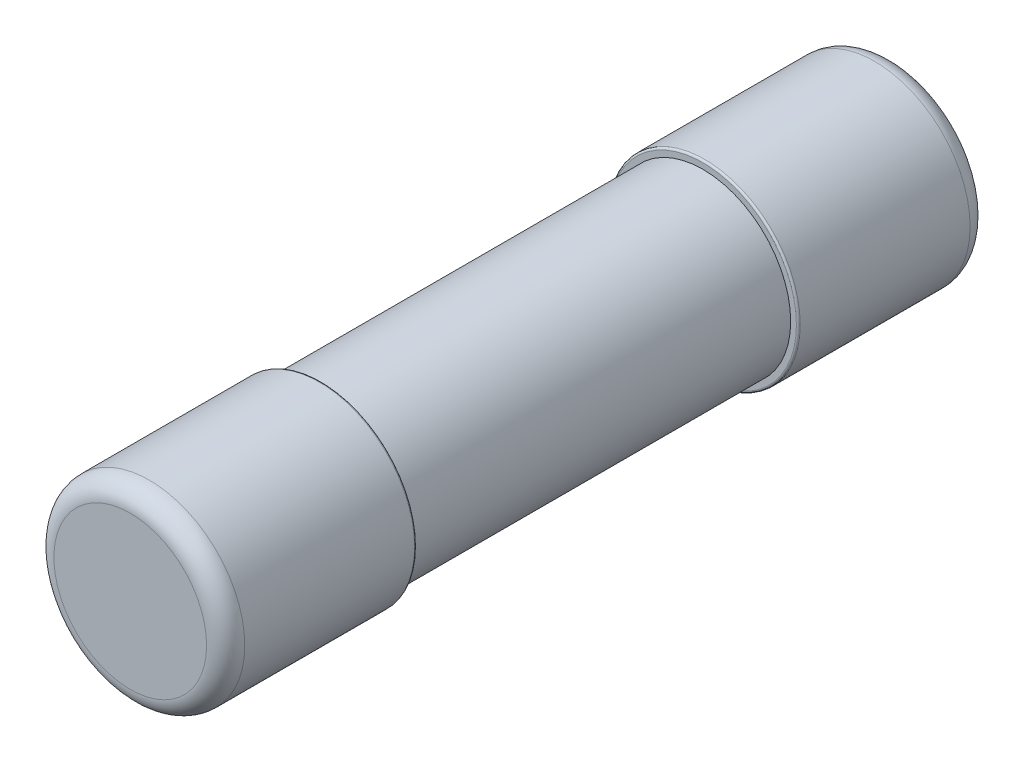
ISO-10303-21;
HEADER;
FILE_DESCRIPTION(('STEP AP214'),'2;1');
FILE_NAME('part.step','',(''),(''),'','','');
FILE_SCHEMA(('AUTOMOTIVE_DESIGN { 1 0 10303 214 1 1 1 1 }'));
ENDSEC;
DATA;
#1=APPLICATION_CONTEXT('core data for automotive mechanical design processes');
#2=APPLICATION_PROTOCOL_DEFINITION('international standard','automotive_design',2000,#1);
#3=PRODUCT_CONTEXT('',#1,'mechanical');
#4=PRODUCT('Part','Part','',(#3));
#5=PRODUCT_RELATED_PRODUCT_CATEGORY('part','',(#4));
#6=PRODUCT_DEFINITION_FORMATION('','',#4);
#7=PRODUCT_DEFINITION_CONTEXT('part definition',#1,'design');
#8=PRODUCT_DEFINITION('design','',#6,#7);
#9=PRODUCT_DEFINITION_SHAPE('','',#8);
#10=(LENGTH_UNIT() NAMED_UNIT(*) SI_UNIT(.MILLI.,.METRE.));
#11=(NAMED_UNIT(*) PLANE_ANGLE_UNIT() SI_UNIT($,.RADIAN.));
#12=(NAMED_UNIT(*) SI_UNIT($,.STERADIAN.) SOLID_ANGLE_UNIT());
#13=UNCERTAINTY_MEASURE_WITH_UNIT(LENGTH_MEASURE(1.E-05),#10,'distance_accuracy_value','');
#14=(GEOMETRIC_REPRESENTATION_CONTEXT(3) GLOBAL_UNCERTAINTY_ASSIGNED_CONTEXT((#13)) GLOBAL_UNIT_ASSIGNED_CONTEXT((#10,
#11,#12)) REPRESENTATION_CONTEXT('',''));
#15=CARTESIAN_POINT('',(0.,0.,0.));
#16=DIRECTION('',(0.,0.,1.));
#17=DIRECTION('',(1.,0.,0.));
#18=AXIS2_PLACEMENT_3D('',#15,#16,#17);
#19=CARTESIAN_POINT('',(0.,0.,-10.));
#20=DIRECTION('',(0.,0.,-1.));
#21=DIRECTION('',(-1.,0.,0.));
#22=AXIS2_PLACEMENT_3D('',#19,#20,#21);
#23=PLANE('',#22);
#24=CARTESIAN_POINT('',(0.,0.,-10.));
#25=DIRECTION('',(0.,0.,1.));
#26=DIRECTION('',(1.,0.,0.));
#27=AXIS2_PLACEMENT_3D('',#24,#25,#26);
#28=CIRCLE('',#27,2.);
#29=CARTESIAN_POINT('',(2.,0.,-10.));
#30=VERTEX_POINT('',#29);
#31=EDGE_CURVE('E79',#30,#30,#28,.T.);
#32=ORIENTED_EDGE('',*,*,#31,.F.);
#33=EDGE_LOOP('',(#32));
#34=FACE_BOUND('',#33,.T.);
#35=ADVANCED_FACE('F14',(#34),#23,.T.);
#36=CARTESIAN_POINT('',(0.,0.,10.));
#37=DIRECTION('',(0.,0.,-1.));
#38=DIRECTION('',(-1.,0.,0.));
#39=AXIS2_PLACEMENT_3D('',#36,#37,#38);
#40=PLANE('',#39);
#41=CARTESIAN_POINT('',(0.,0.,10.));
#42=DIRECTION('',(0.,0.,-1.));
#43=DIRECTION('',(1.,0.,0.));
#44=AXIS2_PLACEMENT_3D('',#41,#42,#43);
#45=CIRCLE('',#44,2.);
#46=CARTESIAN_POINT('',(2.,0.,10.));
#47=VERTEX_POINT('',#46);
#48=EDGE_CURVE('E58',#47,#47,#45,.T.);
#49=ORIENTED_EDGE('',*,*,#48,.F.);
#50=EDGE_LOOP('',(#49));
#51=FACE_BOUND('',#50,.T.);
#52=ADVANCED_FACE('F44',(#51),#40,.F.);
#53=CARTESIAN_POINT('',(0.,0.,-9.5));
#54=DIRECTION('',(0.,0.,-1.));
#55=DIRECTION('',(-1.,0.,0.));
#56=AXIS2_PLACEMENT_3D('',#53,#54,#55);
#57=TOROIDAL_SURFACE('',#56,2.,0.5);
#58=ORIENTED_EDGE('',*,*,#31,.T.);
#59=EDGE_LOOP('',(#58));
#60=FACE_BOUND('',#59,.T.);
#61=CARTESIAN_POINT('',(0.,0.,-9.5));
#62=DIRECTION('',(0.,0.,1.));
#63=DIRECTION('',(1.,0.,0.));
#64=AXIS2_PLACEMENT_3D('',#61,#62,#63);
#65=CIRCLE('',#64,2.5);
#66=CARTESIAN_POINT('',(2.5,0.,-9.5));
#67=VERTEX_POINT('',#66);
#68=EDGE_CURVE('E87',#67,#67,#65,.T.);
#69=ORIENTED_EDGE('',*,*,#68,.F.);
#70=EDGE_LOOP('',(#69));
#71=FACE_BOUND('',#70,.T.);
#72=ADVANCED_FACE('F33',(#60,#71),#57,.T.);
#73=CARTESIAN_POINT('',(0.,0.,9.5));
#74=DIRECTION('',(0.,0.,-1.));
#75=DIRECTION('',(-1.,0.,0.));
#76=AXIS2_PLACEMENT_3D('',#73,#74,#75);
#77=TOROIDAL_SURFACE('',#76,2.,0.5);
#78=CARTESIAN_POINT('',(0.,0.,9.5));
#79=DIRECTION('',(0.,0.,1.));
#80=DIRECTION('',(1.,0.,0.));
#81=AXIS2_PLACEMENT_3D('',#78,#79,#80);
#82=CIRCLE('',#81,2.5);
#83=CARTESIAN_POINT('',(2.5,0.,9.5));
#84=VERTEX_POINT('',#83);
#85=EDGE_CURVE('E89',#84,#84,#82,.F.);
#86=ORIENTED_EDGE('',*,*,#85,.F.);
#87=EDGE_LOOP('',(#86));
#88=FACE_BOUND('',#87,.T.);
#89=ORIENTED_EDGE('',*,*,#48,.T.);
#90=EDGE_LOOP('',(#89));
#91=FACE_BOUND('',#90,.T.);
#92=ADVANCED_FACE('F43',(#88,#91),#77,.T.);
#93=CARTESIAN_POINT('',(0.,0.,-5.));
#94=DIRECTION('',(0.,0.,1.));
#95=DIRECTION('',(1.,0.,0.));
#96=AXIS2_PLACEMENT_3D('',#93,#94,#95);
#97=CYLINDRICAL_SURFACE('',#96,2.5);
#98=CARTESIAN_POINT('',(0.,0.,-5.05));
#99=DIRECTION('',(0.,0.,-1.));
#100=DIRECTION('',(-1.,0.,0.));
#101=AXIS2_PLACEMENT_3D('',#98,#99,#100);
#102=CIRCLE('',#101,2.5);
#103=CARTESIAN_POINT('',(-2.5,0.,-5.05));
#104=VERTEX_POINT('',#103);
#105=EDGE_CURVE('E94',#104,#104,#102,.F.);
#106=ORIENTED_EDGE('',*,*,#105,.F.);
#107=EDGE_LOOP('',(#106));
#108=FACE_BOUND('',#107,.T.);
#109=ORIENTED_EDGE('',*,*,#68,.T.);
#110=EDGE_LOOP('',(#109));
#111=FACE_BOUND('',#110,.T.);
#112=ADVANCED_FACE('F219',(#108,#111),#97,.T.);
#113=CARTESIAN_POINT('',(0.,0.,5.));
#114=DIRECTION('',(0.,0.,1.));
#115=DIRECTION('',(1.,0.,0.));
#116=AXIS2_PLACEMENT_3D('',#113,#114,#115);
#117=CYLINDRICAL_SURFACE('',#116,2.5);
#118=CARTESIAN_POINT('',(0.,0.,5.05));
#119=DIRECTION('',(0.,0.,-1.));
#120=DIRECTION('',(-1.,0.,0.));
#121=AXIS2_PLACEMENT_3D('',#118,#119,#120);
#122=CIRCLE('',#121,2.5);
#123=CARTESIAN_POINT('',(-2.5,0.,5.05));
#124=VERTEX_POINT('',#123);
#125=EDGE_CURVE('E130',#124,#124,#122,.T.);
#126=ORIENTED_EDGE('',*,*,#125,.F.);
#127=EDGE_LOOP('',(#126));
#128=FACE_BOUND('',#127,.T.);
#129=ORIENTED_EDGE('',*,*,#85,.T.);
#130=EDGE_LOOP('',(#129));
#131=FACE_BOUND('',#130,.T.);
#132=ADVANCED_FACE('F118',(#128,#131),#117,.T.);
#133=CARTESIAN_POINT('',(0.,0.,-5.05));
#134=DIRECTION('',(0.,0.,-1.));
#135=DIRECTION('',(-1.,0.,0.));
#136=AXIS2_PLACEMENT_3D('',#133,#134,#135);
#137=TOROIDAL_SURFACE('',#136,2.45,0.05);
#138=ORIENTED_EDGE('',*,*,#105,.T.);
#139=EDGE_LOOP('',(#138));
#140=FACE_BOUND('',#139,.T.);
#141=CARTESIAN_POINT('',(0.,0.,-5.));
#142=DIRECTION('',(0.,0.,-1.));
#143=DIRECTION('',(1.,0.,0.));
#144=AXIS2_PLACEMENT_3D('',#141,#142,#143);
#145=CIRCLE('',#144,2.45);
#146=CARTESIAN_POINT('',(2.45,0.,-5.));
#147=VERTEX_POINT('',#146);
#148=EDGE_CURVE('E134',#147,#147,#145,.T.);
#149=ORIENTED_EDGE('',*,*,#148,.T.);
#150=EDGE_LOOP('',(#149));
#151=FACE_BOUND('',#150,.T.);
#152=ADVANCED_FACE('F106',(#140,#151),#137,.T.);
#153=CARTESIAN_POINT('',(0.,0.,5.05));
#154=DIRECTION('',(0.,0.,-1.));
#155=DIRECTION('',(-1.,0.,0.));
#156=AXIS2_PLACEMENT_3D('',#153,#154,#155);
#157=TOROIDAL_SURFACE('',#156,2.45,0.05);
#158=CARTESIAN_POINT('',(0.,0.,5.));
#159=DIRECTION('',(0.,0.,1.));
#160=DIRECTION('',(1.,0.,0.));
#161=AXIS2_PLACEMENT_3D('',#158,#159,#160);
#162=CIRCLE('',#161,2.45);
#163=CARTESIAN_POINT('',(2.45,0.,5.));
#164=VERTEX_POINT('',#163);
#165=EDGE_CURVE('E25',#164,#164,#162,.F.);
#166=ORIENTED_EDGE('',*,*,#165,.F.);
#167=EDGE_LOOP('',(#166));
#168=FACE_BOUND('',#167,.T.);
#169=ORIENTED_EDGE('',*,*,#125,.T.);
#170=EDGE_LOOP('',(#169));
#171=FACE_BOUND('',#170,.T.);
#172=ADVANCED_FACE('F117',(#168,#171),#157,.T.);
#173=CARTESIAN_POINT('',(0.,0.,-5.));
#174=DIRECTION('',(0.,0.,-1.));
#175=DIRECTION('',(-1.,0.,0.));
#176=AXIS2_PLACEMENT_3D('',#173,#174,#175);
#177=PLANE('',#176);
#178=CARTESIAN_POINT('',(0.,0.,-5.));
#179=DIRECTION('',(0.,0.,1.));
#180=DIRECTION('',(1.,0.,0.));
#181=AXIS2_PLACEMENT_3D('',#178,#179,#180);
#182=CIRCLE('',#181,2.3);
#183=CARTESIAN_POINT('',(2.3,0.,-5.));
#184=VERTEX_POINT('',#183);
#185=EDGE_CURVE('E18',#184,#184,#182,.T.);
#186=ORIENTED_EDGE('',*,*,#185,.F.);
#187=EDGE_LOOP('',(#186));
#188=FACE_BOUND('',#187,.T.);
#189=ORIENTED_EDGE('',*,*,#148,.F.);
#190=EDGE_LOOP('',(#189));
#191=FACE_BOUND('',#190,.T.);
#192=ADVANCED_FACE('F163',(#188,#191),#177,.F.);
#193=CARTESIAN_POINT('',(0.,0.,5.));
#194=DIRECTION('',(0.,0.,-1.));
#195=DIRECTION('',(-1.,0.,0.));
#196=AXIS2_PLACEMENT_3D('',#193,#194,#195);
#197=PLANE('',#196);
#198=CARTESIAN_POINT('',(0.,0.,5.));
#199=DIRECTION('',(0.,0.,1.));
#200=DIRECTION('',(1.,0.,0.));
#201=AXIS2_PLACEMENT_3D('',#198,#199,#200);
#202=CIRCLE('',#201,2.3);
#203=CARTESIAN_POINT('',(2.3,0.,5.));
#204=VERTEX_POINT('',#203);
#205=EDGE_CURVE('E9',#204,#204,#202,.F.);
#206=ORIENTED_EDGE('',*,*,#205,.F.);
#207=EDGE_LOOP('',(#206));
#208=FACE_BOUND('',#207,.T.);
#209=ORIENTED_EDGE('',*,*,#165,.T.);
#210=EDGE_LOOP('',(#209));
#211=FACE_BOUND('',#210,.T.);
#212=ADVANCED_FACE('F147',(#208,#211),#197,.T.);
#213=CARTESIAN_POINT('',(0.,0.,0.));
#214=DIRECTION('',(0.,0.,1.));
#215=DIRECTION('',(1.,0.,0.));
#216=AXIS2_PLACEMENT_3D('',#213,#214,#215);
#217=CYLINDRICAL_SURFACE('',#216,2.3);
#218=ORIENTED_EDGE('',*,*,#205,.T.);
#219=EDGE_LOOP('',(#218));
#220=FACE_BOUND('',#219,.T.);
#221=ORIENTED_EDGE('',*,*,#185,.T.);
#222=EDGE_LOOP('',(#221));
#223=FACE_BOUND('',#222,.T.);
#224=ADVANCED_FACE('F162',(#220,#223),#217,.T.);
#225=CLOSED_SHELL('',(#35,#52,#72,#92,#112,#132,#152,#172,#192,#212,#224));
#226=MANIFOLD_SOLID_BREP('B1',#225);
#227=ADVANCED_BREP_SHAPE_REPRESENTATION('',(#18,#226),#14);
#228=SHAPE_DEFINITION_REPRESENTATION(#9,#227);
ENDSEC;
END-ISO-10303-21;
